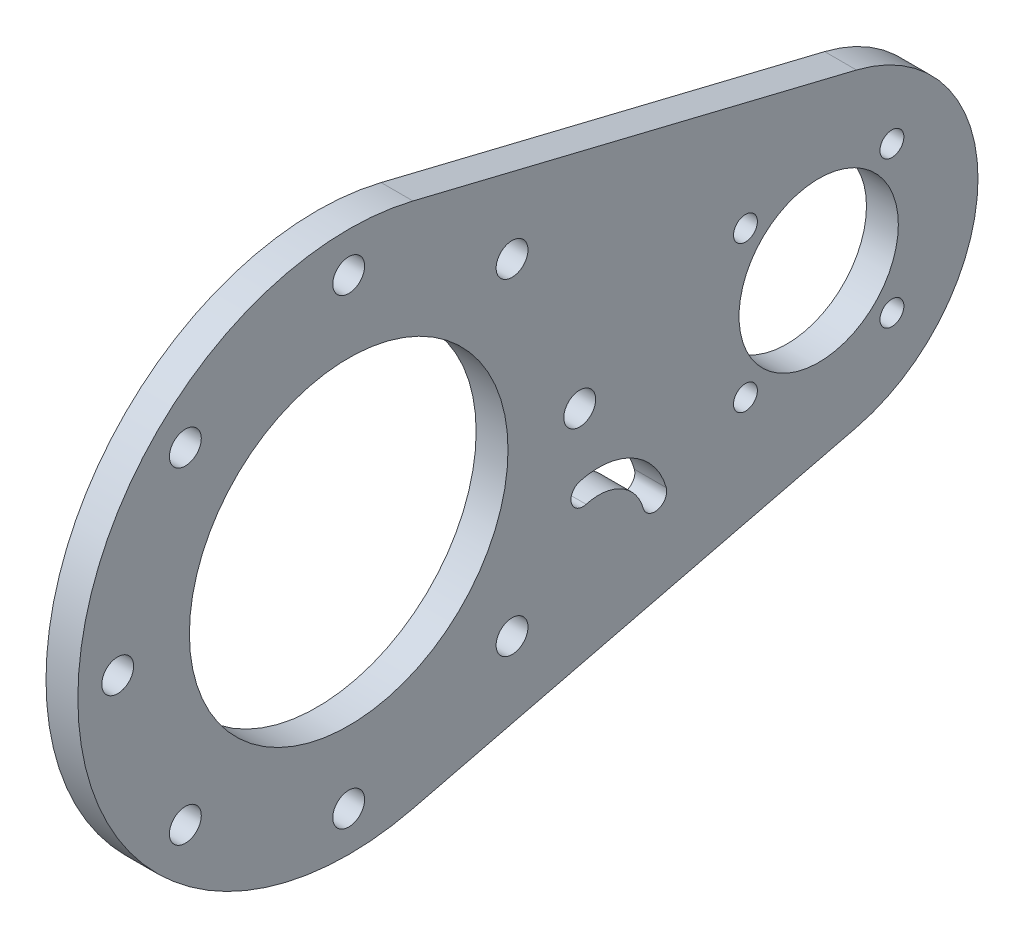
ISO-10303-21;
HEADER;
FILE_DESCRIPTION(('STEP AP214'),'2;1');
FILE_NAME('part.step','',(''),(''),'','','');
FILE_SCHEMA(('AUTOMOTIVE_DESIGN { 1 0 10303 214 1 1 1 1 }'));
ENDSEC;
DATA;
#1=APPLICATION_CONTEXT('core data for automotive mechanical design processes');
#2=APPLICATION_PROTOCOL_DEFINITION('international standard','automotive_design',2000,#1);
#3=PRODUCT_CONTEXT('',#1,'mechanical');
#4=PRODUCT('Part','Part','',(#3));
#5=PRODUCT_RELATED_PRODUCT_CATEGORY('part','',(#4));
#6=PRODUCT_DEFINITION_FORMATION('','',#4);
#7=PRODUCT_DEFINITION_CONTEXT('part definition',#1,'design');
#8=PRODUCT_DEFINITION('design','',#6,#7);
#9=PRODUCT_DEFINITION_SHAPE('','',#8);
#10=(LENGTH_UNIT() NAMED_UNIT(*) SI_UNIT(.MILLI.,.METRE.));
#11=(NAMED_UNIT(*) PLANE_ANGLE_UNIT() SI_UNIT($,.RADIAN.));
#12=(NAMED_UNIT(*) SI_UNIT($,.STERADIAN.) SOLID_ANGLE_UNIT());
#13=UNCERTAINTY_MEASURE_WITH_UNIT(LENGTH_MEASURE(1.E-05),#10,'distance_accuracy_value','');
#14=(GEOMETRIC_REPRESENTATION_CONTEXT(3) GLOBAL_UNCERTAINTY_ASSIGNED_CONTEXT((#13)) GLOBAL_UNIT_ASSIGNED_CONTEXT((#10,
#11,#12)) REPRESENTATION_CONTEXT('',''));
#15=CARTESIAN_POINT('',(0.,0.,0.));
#16=DIRECTION('',(0.,0.,1.));
#17=DIRECTION('',(1.,0.,0.));
#18=AXIS2_PLACEMENT_3D('',#15,#16,#17);
#19=CARTESIAN_POINT('',(4.,33.0289366746333,-8.06779661016949));
#20=DIRECTION('',(0.,0.971439313959804,-0.23728813559322));
#21=DIRECTION('',(0.,0.23728813559322,0.971439313959804));
#22=AXIS2_PLACEMENT_3D('',#19,#20,#21);
#23=PLANE('',#22);
#24=DIRECTION('',(0.,-0.23728813559322,-0.971439313959804));
#25=VECTOR('',#24,1.);
#26=CARTESIAN_POINT('',(0.,33.0289366746333,-8.06779661016949));
#27=LINE('',#26,#25);
#28=CARTESIAN_POINT('',(0.,33.0289366746333,-8.06779661016949));
#29=VERTEX_POINT('',#28);
#30=CARTESIAN_POINT('',(0.,19.4287862791961,-63.7457627118644));
#31=VERTEX_POINT('',#30);
#32=EDGE_CURVE('E281',#29,#31,#27,.T.);
#33=ORIENTED_EDGE('',*,*,#32,.F.);
#34=DIRECTION('',(-1.,0.,0.));
#35=VECTOR('',#34,1.);
#36=CARTESIAN_POINT('',(4.,33.0289366746333,-8.06779661016949));
#37=LINE('',#36,#35);
#38=CARTESIAN_POINT('',(4.,33.0289366746333,-8.06779661016949));
#39=VERTEX_POINT('',#38);
#40=EDGE_CURVE('E11',#39,#29,#37,.T.);
#41=ORIENTED_EDGE('',*,*,#40,.F.);
#42=DIRECTION('',(0.,-0.23728813559322,-0.971439313959804));
#43=VECTOR('',#42,1.);
#44=CARTESIAN_POINT('',(4.,33.0289366746333,-8.06779661016949));
#45=LINE('',#44,#43);
#46=CARTESIAN_POINT('',(4.,19.4287862791961,-63.7457627118644));
#47=VERTEX_POINT('',#46);
#48=EDGE_CURVE('E210',#39,#47,#45,.T.);
#49=ORIENTED_EDGE('',*,*,#48,.T.);
#50=DIRECTION('',(-1.,0.,0.));
#51=VECTOR('',#50,1.);
#52=CARTESIAN_POINT('',(4.,19.4287862791961,-63.7457627118644));
#53=LINE('',#52,#51);
#54=EDGE_CURVE('E225',#47,#31,#53,.T.);
#55=ORIENTED_EDGE('',*,*,#54,.T.);
#56=EDGE_LOOP('',(#33,#41,#49,#55));
#57=FACE_BOUND('',#56,.T.);
#58=ADVANCED_FACE('F41',(#57),#23,.T.);
#59=CARTESIAN_POINT('',(4.,0.,0.));
#60=DIRECTION('',(-1.,0.,0.));
#61=DIRECTION('',(0.,0.,1.));
#62=AXIS2_PLACEMENT_3D('',#59,#60,#61);
#63=CYLINDRICAL_SURFACE('',#62,34.);
#64=CARTESIAN_POINT('',(0.,0.,0.));
#65=DIRECTION('',(1.,0.,0.));
#66=DIRECTION('',(0.,0.,-1.));
#67=AXIS2_PLACEMENT_3D('',#64,#65,#66);
#68=CIRCLE('',#67,34.);
#69=CARTESIAN_POINT('',(0.,-33.0289366746333,-8.06779661016949));
#70=VERTEX_POINT('',#69);
#71=EDGE_CURVE('E285',#29,#70,#68,.T.);
#72=ORIENTED_EDGE('',*,*,#71,.T.);
#73=DIRECTION('',(-1.,0.,0.));
#74=VECTOR('',#73,1.);
#75=CARTESIAN_POINT('',(4.,-33.0289366746333,-8.06779661016949));
#76=LINE('',#75,#74);
#77=CARTESIAN_POINT('',(4.,-33.0289366746333,-8.06779661016949));
#78=VERTEX_POINT('',#77);
#79=EDGE_CURVE('E50',#78,#70,#76,.T.);
#80=ORIENTED_EDGE('',*,*,#79,.F.);
#81=CARTESIAN_POINT('',(4.,0.,0.));
#82=DIRECTION('',(1.,0.,0.));
#83=DIRECTION('',(0.,0.,-1.));
#84=AXIS2_PLACEMENT_3D('',#81,#82,#83);
#85=CIRCLE('',#84,34.);
#86=EDGE_CURVE('E214',#39,#78,#85,.T.);
#87=ORIENTED_EDGE('',*,*,#86,.F.);
#88=ORIENTED_EDGE('',*,*,#40,.T.);
#89=EDGE_LOOP('',(#72,#80,#87,#88));
#90=FACE_BOUND('',#89,.T.);
#91=ADVANCED_FACE('F310',(#90),#63,.T.);
#92=CARTESIAN_POINT('',(4.,-33.0289366746333,-8.06779661016949));
#93=DIRECTION('',(0.,0.971439313959804,0.23728813559322));
#94=DIRECTION('',(0.,-0.23728813559322,0.971439313959804));
#95=AXIS2_PLACEMENT_3D('',#92,#93,#94);
#96=PLANE('',#95);
#97=DIRECTION('',(0.,0.23728813559322,-0.971439313959804));
#98=VECTOR('',#97,1.);
#99=CARTESIAN_POINT('',(0.,-33.0289366746333,-8.06779661016949));
#100=LINE('',#99,#98);
#101=CARTESIAN_POINT('',(0.,-19.4287862791961,-63.7457627118644));
#102=VERTEX_POINT('',#101);
#103=EDGE_CURVE('E289',#70,#102,#100,.T.);
#104=ORIENTED_EDGE('',*,*,#103,.T.);
#105=DIRECTION('',(-1.,0.,0.));
#106=VECTOR('',#105,1.);
#107=CARTESIAN_POINT('',(4.,-19.4287862791961,-63.7457627118644));
#108=LINE('',#107,#106);
#109=CARTESIAN_POINT('',(4.,-19.4287862791961,-63.7457627118644));
#110=VERTEX_POINT('',#109);
#111=EDGE_CURVE('E298',#110,#102,#108,.T.);
#112=ORIENTED_EDGE('',*,*,#111,.F.);
#113=DIRECTION('',(0.,0.23728813559322,-0.971439313959804));
#114=VECTOR('',#113,1.);
#115=CARTESIAN_POINT('',(4.,-33.0289366746333,-8.06779661016949));
#116=LINE('',#115,#114);
#117=EDGE_CURVE('E218',#78,#110,#116,.T.);
#118=ORIENTED_EDGE('',*,*,#117,.F.);
#119=ORIENTED_EDGE('',*,*,#79,.T.);
#120=EDGE_LOOP('',(#104,#112,#118,#119));
#121=FACE_BOUND('',#120,.T.);
#122=ADVANCED_FACE('F305',(#121),#96,.F.);
#123=CARTESIAN_POINT('',(4.,0.,-59.));
#124=DIRECTION('',(-1.,0.,0.));
#125=DIRECTION('',(0.,0.,1.));
#126=AXIS2_PLACEMENT_3D('',#123,#124,#125);
#127=CYLINDRICAL_SURFACE('',#126,9.99999999999999);
#128=CARTESIAN_POINT('',(4.,0.,-59.));
#129=DIRECTION('',(1.,0.,0.));
#130=DIRECTION('',(0.,0.,-1.));
#131=AXIS2_PLACEMENT_3D('',#128,#129,#130);
#132=CIRCLE('',#131,9.99999999999999);
#133=CARTESIAN_POINT('',(4.,0.,-69.));
#134=VERTEX_POINT('',#133);
#135=EDGE_CURVE('E206',#134,#134,#132,.T.);
#136=ORIENTED_EDGE('',*,*,#135,.T.);
#137=EDGE_LOOP('',(#136));
#138=FACE_BOUND('',#137,.T.);
#139=CARTESIAN_POINT('',(0.,0.,-59.));
#140=DIRECTION('',(1.,0.,0.));
#141=DIRECTION('',(0.,0.,-1.));
#142=AXIS2_PLACEMENT_3D('',#139,#140,#141);
#143=CIRCLE('',#142,9.99999999999999);
#144=CARTESIAN_POINT('',(0.,0.,-69.));
#145=VERTEX_POINT('',#144);
#146=EDGE_CURVE('E277',#145,#145,#143,.T.);
#147=ORIENTED_EDGE('',*,*,#146,.F.);
#148=EDGE_LOOP('',(#147));
#149=FACE_BOUND('',#148,.T.);
#150=ADVANCED_FACE('F341',(#138,#149),#127,.F.);
#151=CARTESIAN_POINT('',(4.,0.,0.));
#152=DIRECTION('',(-1.,0.,0.));
#153=DIRECTION('',(0.,0.,1.));
#154=AXIS2_PLACEMENT_3D('',#151,#152,#153);
#155=CYLINDRICAL_SURFACE('',#154,20.);
#156=CARTESIAN_POINT('',(4.,0.,0.));
#157=DIRECTION('',(1.,0.,0.));
#158=DIRECTION('',(0.,0.,-1.));
#159=AXIS2_PLACEMENT_3D('',#156,#157,#158);
#160=CIRCLE('',#159,20.);
#161=CARTESIAN_POINT('',(4.,0.,-20.));
#162=VERTEX_POINT('',#161);
#163=EDGE_CURVE('E202',#162,#162,#160,.T.);
#164=ORIENTED_EDGE('',*,*,#163,.T.);
#165=EDGE_LOOP('',(#164));
#166=FACE_BOUND('',#165,.T.);
#167=CARTESIAN_POINT('',(0.,0.,0.));
#168=DIRECTION('',(1.,0.,0.));
#169=DIRECTION('',(0.,0.,-1.));
#170=AXIS2_PLACEMENT_3D('',#167,#168,#169);
#171=CIRCLE('',#170,20.);
#172=CARTESIAN_POINT('',(0.,0.,-20.));
#173=VERTEX_POINT('',#172);
#174=EDGE_CURVE('E273',#173,#173,#171,.T.);
#175=ORIENTED_EDGE('',*,*,#174,.F.);
#176=EDGE_LOOP('',(#175));
#177=FACE_BOUND('',#176,.T.);
#178=ADVANCED_FACE('F344',(#166,#177),#155,.F.);
#179=CARTESIAN_POINT('',(4.,29.,0.));
#180=DIRECTION('',(-1.,0.,0.));
#181=DIRECTION('',(0.,0.,1.));
#182=AXIS2_PLACEMENT_3D('',#179,#180,#181);
#183=CYLINDRICAL_SURFACE('',#182,2.);
#184=CARTESIAN_POINT('',(4.,29.,0.));
#185=DIRECTION('',(1.,0.,0.));
#186=DIRECTION('',(0.,0.,-1.));
#187=AXIS2_PLACEMENT_3D('',#184,#185,#186);
#188=CIRCLE('',#187,2.);
#189=CARTESIAN_POINT('',(4.,29.,-2.));
#190=VERTEX_POINT('',#189);
#191=EDGE_CURVE('E198',#190,#190,#188,.T.);
#192=ORIENTED_EDGE('',*,*,#191,.T.);
#193=EDGE_LOOP('',(#192));
#194=FACE_BOUND('',#193,.T.);
#195=CARTESIAN_POINT('',(0.,29.,0.));
#196=DIRECTION('',(1.,0.,0.));
#197=DIRECTION('',(0.,0.,-1.));
#198=AXIS2_PLACEMENT_3D('',#195,#196,#197);
#199=CIRCLE('',#198,2.);
#200=CARTESIAN_POINT('',(0.,29.,-2.));
#201=VERTEX_POINT('',#200);
#202=EDGE_CURVE('E269',#201,#201,#199,.T.);
#203=ORIENTED_EDGE('',*,*,#202,.F.);
#204=EDGE_LOOP('',(#203));
#205=FACE_BOUND('',#204,.T.);
#206=ADVANCED_FACE('F348',(#194,#205),#183,.F.);
#207=CARTESIAN_POINT('',(4.,20.5060966544099,-20.5060966544099));
#208=DIRECTION('',(-1.,0.,0.));
#209=DIRECTION('',(0.,0.,1.));
#210=AXIS2_PLACEMENT_3D('',#207,#208,#209);
#211=CYLINDRICAL_SURFACE('',#210,2.);
#212=CARTESIAN_POINT('',(4.,20.5060966544099,-20.5060966544099));
#213=DIRECTION('',(1.,0.,0.));
#214=DIRECTION('',(0.,0.,-1.));
#215=AXIS2_PLACEMENT_3D('',#212,#213,#214);
#216=CIRCLE('',#215,2.);
#217=CARTESIAN_POINT('',(4.,20.5060966544099,-22.5060966544099));
#218=VERTEX_POINT('',#217);
#219=EDGE_CURVE('E194',#218,#218,#216,.T.);
#220=ORIENTED_EDGE('',*,*,#219,.T.);
#221=EDGE_LOOP('',(#220));
#222=FACE_BOUND('',#221,.T.);
#223=CARTESIAN_POINT('',(0.,20.5060966544099,-20.5060966544099));
#224=DIRECTION('',(1.,0.,0.));
#225=DIRECTION('',(0.,0.,-1.));
#226=AXIS2_PLACEMENT_3D('',#223,#224,#225);
#227=CIRCLE('',#226,2.);
#228=CARTESIAN_POINT('',(0.,20.5060966544099,-22.5060966544099));
#229=VERTEX_POINT('',#228);
#230=EDGE_CURVE('E265',#229,#229,#227,.T.);
#231=ORIENTED_EDGE('',*,*,#230,.F.);
#232=EDGE_LOOP('',(#231));
#233=FACE_BOUND('',#232,.T.);
#234=ADVANCED_FACE('F352',(#222,#233),#211,.F.);
#235=CARTESIAN_POINT('',(4.,0.,-29.));
#236=DIRECTION('',(-1.,0.,0.));
#237=DIRECTION('',(0.,0.,1.));
#238=AXIS2_PLACEMENT_3D('',#235,#236,#237);
#239=CYLINDRICAL_SURFACE('',#238,2.);
#240=CARTESIAN_POINT('',(4.,0.,-29.));
#241=DIRECTION('',(1.,0.,0.));
#242=DIRECTION('',(0.,0.,-1.));
#243=AXIS2_PLACEMENT_3D('',#240,#241,#242);
#244=CIRCLE('',#243,2.);
#245=CARTESIAN_POINT('',(4.,0.,-31.));
#246=VERTEX_POINT('',#245);
#247=EDGE_CURVE('E190',#246,#246,#244,.T.);
#248=ORIENTED_EDGE('',*,*,#247,.T.);
#249=EDGE_LOOP('',(#248));
#250=FACE_BOUND('',#249,.T.);
#251=CARTESIAN_POINT('',(0.,0.,-29.));
#252=DIRECTION('',(1.,0.,0.));
#253=DIRECTION('',(0.,0.,-1.));
#254=AXIS2_PLACEMENT_3D('',#251,#252,#253);
#255=CIRCLE('',#254,2.);
#256=CARTESIAN_POINT('',(0.,0.,-31.));
#257=VERTEX_POINT('',#256);
#258=EDGE_CURVE('E261',#257,#257,#255,.T.);
#259=ORIENTED_EDGE('',*,*,#258,.F.);
#260=EDGE_LOOP('',(#259));
#261=FACE_BOUND('',#260,.T.);
#262=ADVANCED_FACE('F356',(#250,#261),#239,.F.);
#263=CARTESIAN_POINT('',(4.,-20.5060966544099,-20.5060966544099));
#264=DIRECTION('',(-1.,0.,0.));
#265=DIRECTION('',(0.,0.,1.));
#266=AXIS2_PLACEMENT_3D('',#263,#264,#265);
#267=CYLINDRICAL_SURFACE('',#266,2.);
#268=CARTESIAN_POINT('',(4.,-20.5060966544099,-20.5060966544099));
#269=DIRECTION('',(1.,0.,0.));
#270=DIRECTION('',(0.,0.,-1.));
#271=AXIS2_PLACEMENT_3D('',#268,#269,#270);
#272=CIRCLE('',#271,2.);
#273=CARTESIAN_POINT('',(4.,-20.5060966544099,-22.5060966544099));
#274=VERTEX_POINT('',#273);
#275=EDGE_CURVE('E186',#274,#274,#272,.T.);
#276=ORIENTED_EDGE('',*,*,#275,.T.);
#277=EDGE_LOOP('',(#276));
#278=FACE_BOUND('',#277,.T.);
#279=CARTESIAN_POINT('',(0.,-20.5060966544099,-20.5060966544099));
#280=DIRECTION('',(1.,0.,0.));
#281=DIRECTION('',(0.,0.,-1.));
#282=AXIS2_PLACEMENT_3D('',#279,#280,#281);
#283=CIRCLE('',#282,2.);
#284=CARTESIAN_POINT('',(0.,-20.5060966544099,-22.5060966544099));
#285=VERTEX_POINT('',#284);
#286=EDGE_CURVE('E257',#285,#285,#283,.T.);
#287=ORIENTED_EDGE('',*,*,#286,.F.);
#288=EDGE_LOOP('',(#287));
#289=FACE_BOUND('',#288,.T.);
#290=ADVANCED_FACE('F360',(#278,#289),#267,.F.);
#291=CARTESIAN_POINT('',(4.,-29.,0.));
#292=DIRECTION('',(-1.,0.,0.));
#293=DIRECTION('',(0.,0.,1.));
#294=AXIS2_PLACEMENT_3D('',#291,#292,#293);
#295=CYLINDRICAL_SURFACE('',#294,2.);
#296=CARTESIAN_POINT('',(4.,-29.,0.));
#297=DIRECTION('',(1.,0.,0.));
#298=DIRECTION('',(0.,0.,-1.));
#299=AXIS2_PLACEMENT_3D('',#296,#297,#298);
#300=CIRCLE('',#299,2.);
#301=CARTESIAN_POINT('',(4.,-29.,-2.00000000000001));
#302=VERTEX_POINT('',#301);
#303=EDGE_CURVE('E182',#302,#302,#300,.T.);
#304=ORIENTED_EDGE('',*,*,#303,.T.);
#305=EDGE_LOOP('',(#304));
#306=FACE_BOUND('',#305,.T.);
#307=CARTESIAN_POINT('',(0.,-29.,0.));
#308=DIRECTION('',(1.,0.,0.));
#309=DIRECTION('',(0.,0.,-1.));
#310=AXIS2_PLACEMENT_3D('',#307,#308,#309);
#311=CIRCLE('',#310,2.);
#312=CARTESIAN_POINT('',(0.,-29.,-2.00000000000001));
#313=VERTEX_POINT('',#312);
#314=EDGE_CURVE('E253',#313,#313,#311,.T.);
#315=ORIENTED_EDGE('',*,*,#314,.F.);
#316=EDGE_LOOP('',(#315));
#317=FACE_BOUND('',#316,.T.);
#318=ADVANCED_FACE('F364',(#306,#317),#295,.F.);
#319=CARTESIAN_POINT('',(4.,-20.5060966544099,20.5060966544099));
#320=DIRECTION('',(-1.,0.,0.));
#321=DIRECTION('',(0.,0.,1.));
#322=AXIS2_PLACEMENT_3D('',#319,#320,#321);
#323=CYLINDRICAL_SURFACE('',#322,2.);
#324=CARTESIAN_POINT('',(4.,-20.5060966544099,20.5060966544099));
#325=DIRECTION('',(1.,0.,0.));
#326=DIRECTION('',(0.,0.,-1.));
#327=AXIS2_PLACEMENT_3D('',#324,#325,#326);
#328=CIRCLE('',#327,2.);
#329=CARTESIAN_POINT('',(4.,-20.5060966544099,18.5060966544099));
#330=VERTEX_POINT('',#329);
#331=EDGE_CURVE('E178',#330,#330,#328,.T.);
#332=ORIENTED_EDGE('',*,*,#331,.T.);
#333=EDGE_LOOP('',(#332));
#334=FACE_BOUND('',#333,.T.);
#335=CARTESIAN_POINT('',(0.,-20.5060966544099,20.5060966544099));
#336=DIRECTION('',(1.,0.,0.));
#337=DIRECTION('',(0.,0.,-1.));
#338=AXIS2_PLACEMENT_3D('',#335,#336,#337);
#339=CIRCLE('',#338,2.);
#340=CARTESIAN_POINT('',(0.,-20.5060966544099,18.5060966544099));
#341=VERTEX_POINT('',#340);
#342=EDGE_CURVE('E249',#341,#341,#339,.T.);
#343=ORIENTED_EDGE('',*,*,#342,.F.);
#344=EDGE_LOOP('',(#343));
#345=FACE_BOUND('',#344,.T.);
#346=ADVANCED_FACE('F368',(#334,#345),#323,.F.);
#347=CARTESIAN_POINT('',(4.,0.,29.));
#348=DIRECTION('',(-1.,0.,0.));
#349=DIRECTION('',(0.,0.,1.));
#350=AXIS2_PLACEMENT_3D('',#347,#348,#349);
#351=CYLINDRICAL_SURFACE('',#350,2.);
#352=CARTESIAN_POINT('',(4.,0.,29.));
#353=DIRECTION('',(1.,0.,0.));
#354=DIRECTION('',(0.,0.,-1.));
#355=AXIS2_PLACEMENT_3D('',#352,#353,#354);
#356=CIRCLE('',#355,2.);
#357=CARTESIAN_POINT('',(4.,0.,27.));
#358=VERTEX_POINT('',#357);
#359=EDGE_CURVE('E174',#358,#358,#356,.T.);
#360=ORIENTED_EDGE('',*,*,#359,.T.);
#361=EDGE_LOOP('',(#360));
#362=FACE_BOUND('',#361,.T.);
#363=CARTESIAN_POINT('',(0.,0.,29.));
#364=DIRECTION('',(1.,0.,0.));
#365=DIRECTION('',(0.,0.,-1.));
#366=AXIS2_PLACEMENT_3D('',#363,#364,#365);
#367=CIRCLE('',#366,2.);
#368=CARTESIAN_POINT('',(0.,0.,27.));
#369=VERTEX_POINT('',#368);
#370=EDGE_CURVE('E245',#369,#369,#367,.T.);
#371=ORIENTED_EDGE('',*,*,#370,.F.);
#372=EDGE_LOOP('',(#371));
#373=FACE_BOUND('',#372,.T.);
#374=ADVANCED_FACE('F372',(#362,#373),#351,.F.);
#375=CARTESIAN_POINT('',(4.,20.5060966544099,20.5060966544099));
#376=DIRECTION('',(-1.,0.,0.));
#377=DIRECTION('',(0.,0.,1.));
#378=AXIS2_PLACEMENT_3D('',#375,#376,#377);
#379=CYLINDRICAL_SURFACE('',#378,2.);
#380=CARTESIAN_POINT('',(4.,20.5060966544099,20.5060966544099));
#381=DIRECTION('',(1.,0.,0.));
#382=DIRECTION('',(0.,0.,-1.));
#383=AXIS2_PLACEMENT_3D('',#380,#381,#382);
#384=CIRCLE('',#383,2.);
#385=CARTESIAN_POINT('',(4.,20.5060966544099,18.5060966544099));
#386=VERTEX_POINT('',#385);
#387=EDGE_CURVE('E170',#386,#386,#384,.T.);
#388=ORIENTED_EDGE('',*,*,#387,.T.);
#389=EDGE_LOOP('',(#388));
#390=FACE_BOUND('',#389,.T.);
#391=CARTESIAN_POINT('',(0.,20.5060966544099,20.5060966544099));
#392=DIRECTION('',(1.,0.,0.));
#393=DIRECTION('',(0.,0.,-1.));
#394=AXIS2_PLACEMENT_3D('',#391,#392,#393);
#395=CIRCLE('',#394,2.);
#396=CARTESIAN_POINT('',(0.,20.5060966544099,18.5060966544099));
#397=VERTEX_POINT('',#396);
#398=EDGE_CURVE('E241',#397,#397,#395,.T.);
#399=ORIENTED_EDGE('',*,*,#398,.F.);
#400=EDGE_LOOP('',(#399));
#401=FACE_BOUND('',#400,.T.);
#402=ADVANCED_FACE('F376',(#390,#401),#379,.F.);
#403=CARTESIAN_POINT('',(4.,9.19238815542507,-49.8076118445748));
#404=DIRECTION('',(-1.,0.,0.));
#405=DIRECTION('',(0.,0.,1.));
#406=AXIS2_PLACEMENT_3D('',#403,#404,#405);
#407=CYLINDRICAL_SURFACE('',#406,1.5);
#408=CARTESIAN_POINT('',(4.,9.19238815542507,-49.8076118445748));
#409=DIRECTION('',(1.,0.,0.));
#410=DIRECTION('',(0.,0.,-1.));
#411=AXIS2_PLACEMENT_3D('',#408,#409,#410);
#412=CIRCLE('',#411,1.5);
#413=CARTESIAN_POINT('',(4.,9.19238815542507,-51.3076118445748));
#414=VERTEX_POINT('',#413);
#415=EDGE_CURVE('E166',#414,#414,#412,.T.);
#416=ORIENTED_EDGE('',*,*,#415,.T.);
#417=EDGE_LOOP('',(#416));
#418=FACE_BOUND('',#417,.T.);
#419=CARTESIAN_POINT('',(0.,9.19238815542507,-49.8076118445748));
#420=DIRECTION('',(1.,0.,0.));
#421=DIRECTION('',(0.,0.,-1.));
#422=AXIS2_PLACEMENT_3D('',#419,#420,#421);
#423=CIRCLE('',#422,1.5);
#424=CARTESIAN_POINT('',(0.,9.19238815542507,-51.3076118445748));
#425=VERTEX_POINT('',#424);
#426=EDGE_CURVE('E237',#425,#425,#423,.T.);
#427=ORIENTED_EDGE('',*,*,#426,.F.);
#428=EDGE_LOOP('',(#427));
#429=FACE_BOUND('',#428,.T.);
#430=ADVANCED_FACE('F380',(#418,#429),#407,.F.);
#431=CARTESIAN_POINT('',(4.,9.19238815542517,-68.1923881554251));
#432=DIRECTION('',(-1.,0.,0.));
#433=DIRECTION('',(0.,0.,1.));
#434=AXIS2_PLACEMENT_3D('',#431,#432,#433);
#435=CYLINDRICAL_SURFACE('',#434,1.5);
#436=CARTESIAN_POINT('',(4.,9.19238815542517,-68.1923881554251));
#437=DIRECTION('',(1.,0.,0.));
#438=DIRECTION('',(0.,0.,-1.));
#439=AXIS2_PLACEMENT_3D('',#436,#437,#438);
#440=CIRCLE('',#439,1.5);
#441=CARTESIAN_POINT('',(4.,9.19238815542517,-69.6923881554251));
#442=VERTEX_POINT('',#441);
#443=EDGE_CURVE('E162',#442,#442,#440,.T.);
#444=ORIENTED_EDGE('',*,*,#443,.T.);
#445=EDGE_LOOP('',(#444));
#446=FACE_BOUND('',#445,.T.);
#447=CARTESIAN_POINT('',(0.,9.19238815542517,-68.1923881554251));
#448=DIRECTION('',(1.,0.,0.));
#449=DIRECTION('',(0.,0.,-1.));
#450=AXIS2_PLACEMENT_3D('',#447,#448,#449);
#451=CIRCLE('',#450,1.5);
#452=CARTESIAN_POINT('',(0.,9.19238815542517,-69.6923881554251));
#453=VERTEX_POINT('',#452);
#454=EDGE_CURVE('E233',#453,#453,#451,.T.);
#455=ORIENTED_EDGE('',*,*,#454,.F.);
#456=EDGE_LOOP('',(#455));
#457=FACE_BOUND('',#456,.T.);
#458=ADVANCED_FACE('F384',(#446,#457),#435,.F.);
#459=CARTESIAN_POINT('',(4.,-9.19238815542507,-68.1923881554252));
#460=DIRECTION('',(-1.,0.,0.));
#461=DIRECTION('',(0.,0.,1.));
#462=AXIS2_PLACEMENT_3D('',#459,#460,#461);
#463=CYLINDRICAL_SURFACE('',#462,1.5);
#464=CARTESIAN_POINT('',(4.,-9.19238815542507,-68.1923881554252));
#465=DIRECTION('',(1.,0.,0.));
#466=DIRECTION('',(0.,0.,-1.));
#467=AXIS2_PLACEMENT_3D('',#464,#465,#466);
#468=CIRCLE('',#467,1.5);
#469=CARTESIAN_POINT('',(4.,-9.19238815542507,-69.6923881554252));
#470=VERTEX_POINT('',#469);
#471=EDGE_CURVE('E157',#470,#470,#468,.T.);
#472=ORIENTED_EDGE('',*,*,#471,.T.);
#473=EDGE_LOOP('',(#472));
#474=FACE_BOUND('',#473,.T.);
#475=CARTESIAN_POINT('',(0.,-9.19238815542507,-68.1923881554252));
#476=DIRECTION('',(1.,0.,0.));
#477=DIRECTION('',(0.,0.,-1.));
#478=AXIS2_PLACEMENT_3D('',#475,#476,#477);
#479=CIRCLE('',#478,1.5);
#480=CARTESIAN_POINT('',(0.,-9.19238815542507,-69.6923881554252));
#481=VERTEX_POINT('',#480);
#482=EDGE_CURVE('E229',#481,#481,#479,.T.);
#483=ORIENTED_EDGE('',*,*,#482,.F.);
#484=EDGE_LOOP('',(#483));
#485=FACE_BOUND('',#484,.T.);
#486=ADVANCED_FACE('F387',(#474,#485),#463,.F.);
#487=CARTESIAN_POINT('',(4.,-9.19238815542517,-49.8076118445749));
#488=DIRECTION('',(-1.,0.,0.));
#489=DIRECTION('',(0.,0.,1.));
#490=AXIS2_PLACEMENT_3D('',#487,#488,#489);
#491=CYLINDRICAL_SURFACE('',#490,1.50000000000003);
#492=CARTESIAN_POINT('',(4.,-9.19238815542517,-49.8076118445749));
#493=DIRECTION('',(1.,0.,0.));
#494=DIRECTION('',(0.,0.,-1.));
#495=AXIS2_PLACEMENT_3D('',#492,#493,#494);
#496=CIRCLE('',#495,1.50000000000003);
#497=CARTESIAN_POINT('',(4.,-9.19238815542517,-51.307611844575));
#498=VERTEX_POINT('',#497);
#499=EDGE_CURVE('E153',#498,#498,#496,.T.);
#500=ORIENTED_EDGE('',*,*,#499,.T.);
#501=EDGE_LOOP('',(#500));
#502=FACE_BOUND('',#501,.T.);
#503=CARTESIAN_POINT('',(0.,-9.19238815542517,-49.8076118445749));
#504=DIRECTION('',(1.,0.,0.));
#505=DIRECTION('',(0.,0.,-1.));
#506=AXIS2_PLACEMENT_3D('',#503,#504,#505);
#507=CIRCLE('',#506,1.50000000000003);
#508=CARTESIAN_POINT('',(0.,-9.19238815542517,-51.307611844575));
#509=VERTEX_POINT('',#508);
#510=EDGE_CURVE('E152',#509,#509,#507,.T.);
#511=ORIENTED_EDGE('',*,*,#510,.F.);
#512=EDGE_LOOP('',(#511));
#513=FACE_BOUND('',#512,.T.);
#514=ADVANCED_FACE('F43',(#502,#513),#491,.F.);
#515=CARTESIAN_POINT('',(4.,0.,-59.));
#516=DIRECTION('',(-1.,0.,0.));
#517=DIRECTION('',(0.,0.,1.));
#518=AXIS2_PLACEMENT_3D('',#515,#516,#517);
#519=CYLINDRICAL_SURFACE('',#518,20.);
#520=CARTESIAN_POINT('',(0.,0.,-59.));
#521=DIRECTION('',(1.,0.,0.));
#522=DIRECTION('',(0.,0.,-1.));
#523=AXIS2_PLACEMENT_3D('',#520,#521,#522);
#524=CIRCLE('',#523,20.);
#525=EDGE_CURVE('E158',#102,#31,#524,.T.);
#526=ORIENTED_EDGE('',*,*,#525,.T.);
#527=ORIENTED_EDGE('',*,*,#54,.F.);
#528=CARTESIAN_POINT('',(4.,0.,-59.));
#529=DIRECTION('',(1.,0.,0.));
#530=DIRECTION('',(0.,0.,-1.));
#531=AXIS2_PLACEMENT_3D('',#528,#529,#530);
#532=CIRCLE('',#531,20.);
#533=EDGE_CURVE('E222',#110,#47,#532,.T.);
#534=ORIENTED_EDGE('',*,*,#533,.F.);
#535=ORIENTED_EDGE('',*,*,#111,.T.);
#536=EDGE_LOOP('',(#526,#527,#534,#535));
#537=FACE_BOUND('',#536,.T.);
#538=ADVANCED_FACE('F317',(#537),#519,.T.);
#539=CARTESIAN_POINT('',(4.,0.,0.));
#540=DIRECTION('',(1.,0.,0.));
#541=DIRECTION('',(0.,0.,-1.));
#542=AXIS2_PLACEMENT_3D('',#539,#540,#541);
#543=PLANE('',#542);
#544=CARTESIAN_POINT('',(4.,-9.37359280232875,-29.4005316634005));
#545=DIRECTION('',(1.,0.,0.));
#546=DIRECTION('',(0.,0.,-1.));
#547=AXIS2_PLACEMENT_3D('',#544,#545,#546);
#548=CIRCLE('',#547,1.5);
#549=CARTESIAN_POINT('',(4.,-7.92941021758091,-28.9951470782088));
#550=VERTEX_POINT('',#549);
#551=CARTESIAN_POINT('',(4.,-10.8177753870766,-29.8059162485922));
#552=VERTEX_POINT('',#551);
#553=EDGE_CURVE('E149',#550,#552,#548,.T.);
#554=ORIENTED_EDGE('',*,*,#553,.F.);
#555=CARTESIAN_POINT('',(4.,-16.4168965654573,-31.3775993863806));
#556=DIRECTION('',(1.,0.,0.));
#557=DIRECTION('',(0.,0.,-1.));
#558=AXIS2_PLACEMENT_3D('',#555,#556,#557);
#559=CIRCLE('',#558,8.81552627505025);
#560=CARTESIAN_POINT('',(4.,-14.034444257278,-39.8650857342549));
#561=VERTEX_POINT('',#560);
#562=EDGE_CURVE('E137',#561,#550,#559,.T.);
#563=ORIENTED_EDGE('',*,*,#562,.F.);
#564=CARTESIAN_POINT('',(4.,-14.439828842471,-38.4209031495074));
#565=DIRECTION('',(1.,0.,0.));
#566=DIRECTION('',(0.,0.,-1.));
#567=AXIS2_PLACEMENT_3D('',#564,#565,#566);
#568=CIRCLE('',#567,1.5);
#569=CARTESIAN_POINT('',(4.,-14.8452134276639,-36.9767205647599));
#570=VERTEX_POINT('',#569);
#571=EDGE_CURVE('E112',#570,#561,#568,.T.);
#572=ORIENTED_EDGE('',*,*,#571,.F.);
#573=CARTESIAN_POINT('',(4.,-16.4168965654573,-31.3775993863806));
#574=DIRECTION('',(1.,0.,0.));
#575=DIRECTION('',(0.,0.,-1.));
#576=AXIS2_PLACEMENT_3D('',#573,#574,#575);
#577=CIRCLE('',#576,5.81552627505025);
#578=EDGE_CURVE('E146',#552,#570,#577,.F.);
#579=ORIENTED_EDGE('',*,*,#578,.F.);
#580=EDGE_LOOP('',(#554,#563,#572,#579));
#581=FACE_BOUND('',#580,.T.);
#582=ORIENTED_EDGE('',*,*,#499,.F.);
#583=EDGE_LOOP('',(#582));
#584=FACE_BOUND('',#583,.T.);
#585=ORIENTED_EDGE('',*,*,#471,.F.);
#586=EDGE_LOOP('',(#585));
#587=FACE_BOUND('',#586,.T.);
#588=ORIENTED_EDGE('',*,*,#443,.F.);
#589=EDGE_LOOP('',(#588));
#590=FACE_BOUND('',#589,.T.);
#591=ORIENTED_EDGE('',*,*,#415,.F.);
#592=EDGE_LOOP('',(#591));
#593=FACE_BOUND('',#592,.T.);
#594=ORIENTED_EDGE('',*,*,#387,.F.);
#595=EDGE_LOOP('',(#594));
#596=FACE_BOUND('',#595,.T.);
#597=ORIENTED_EDGE('',*,*,#359,.F.);
#598=EDGE_LOOP('',(#597));
#599=FACE_BOUND('',#598,.T.);
#600=ORIENTED_EDGE('',*,*,#331,.F.);
#601=EDGE_LOOP('',(#600));
#602=FACE_BOUND('',#601,.T.);
#603=ORIENTED_EDGE('',*,*,#303,.F.);
#604=EDGE_LOOP('',(#603));
#605=FACE_BOUND('',#604,.T.);
#606=ORIENTED_EDGE('',*,*,#275,.F.);
#607=EDGE_LOOP('',(#606));
#608=FACE_BOUND('',#607,.T.);
#609=ORIENTED_EDGE('',*,*,#247,.F.);
#610=EDGE_LOOP('',(#609));
#611=FACE_BOUND('',#610,.T.);
#612=ORIENTED_EDGE('',*,*,#219,.F.);
#613=EDGE_LOOP('',(#612));
#614=FACE_BOUND('',#613,.T.);
#615=ORIENTED_EDGE('',*,*,#191,.F.);
#616=EDGE_LOOP('',(#615));
#617=FACE_BOUND('',#616,.T.);
#618=ORIENTED_EDGE('',*,*,#163,.F.);
#619=EDGE_LOOP('',(#618));
#620=FACE_BOUND('',#619,.T.);
#621=ORIENTED_EDGE('',*,*,#135,.F.);
#622=EDGE_LOOP('',(#621));
#623=FACE_BOUND('',#622,.T.);
#624=ORIENTED_EDGE('',*,*,#48,.F.);
#625=ORIENTED_EDGE('',*,*,#86,.T.);
#626=ORIENTED_EDGE('',*,*,#117,.T.);
#627=ORIENTED_EDGE('',*,*,#533,.T.);
#628=EDGE_LOOP('',(#624,#625,#626,#627));
#629=FACE_BOUND('',#628,.T.);
#630=ADVANCED_FACE('F319',(#581,#584,#587,#590,#593,#596,#599,#602,#605,#608,#611,#614,#617,
#620,#623,#629),#543,.T.);
#631=CARTESIAN_POINT('',(0.,0.,0.));
#632=DIRECTION('',(1.,0.,0.));
#633=DIRECTION('',(0.,0.,-1.));
#634=AXIS2_PLACEMENT_3D('',#631,#632,#633);
#635=PLANE('',#634);
#636=CARTESIAN_POINT('',(0.,-16.4168965654573,-31.3775993863806));
#637=DIRECTION('',(-1.,0.,0.));
#638=DIRECTION('',(0.,0.,1.));
#639=AXIS2_PLACEMENT_3D('',#636,#637,#638);
#640=CIRCLE('',#639,8.81552627505025);
#641=CARTESIAN_POINT('',(0.,-7.92941021758091,-28.9951470782088));
#642=VERTEX_POINT('',#641);
#643=CARTESIAN_POINT('',(0.,-14.034444257278,-39.8650857342549));
#644=VERTEX_POINT('',#643);
#645=EDGE_CURVE('E119',#642,#644,#640,.T.);
#646=ORIENTED_EDGE('',*,*,#645,.F.);
#647=CARTESIAN_POINT('',(0.,-9.37359280232875,-29.4005316634005));
#648=DIRECTION('',(-1.,0.,0.));
#649=DIRECTION('',(0.,0.,1.));
#650=AXIS2_PLACEMENT_3D('',#647,#648,#649);
#651=CIRCLE('',#650,1.5);
#652=CARTESIAN_POINT('',(0.,-10.8177753870766,-29.8059162485922));
#653=VERTEX_POINT('',#652);
#654=EDGE_CURVE('E65',#653,#642,#651,.T.);
#655=ORIENTED_EDGE('',*,*,#654,.F.);
#656=CARTESIAN_POINT('',(0.,-16.4168965654573,-31.3775993863806));
#657=DIRECTION('',(1.,0.,0.));
#658=DIRECTION('',(0.,0.,1.));
#659=AXIS2_PLACEMENT_3D('',#656,#657,#658);
#660=CIRCLE('',#659,5.81552627505025);
#661=CARTESIAN_POINT('',(0.,-14.8452134276639,-36.9767205647599));
#662=VERTEX_POINT('',#661);
#663=EDGE_CURVE('E127',#662,#653,#660,.T.);
#664=ORIENTED_EDGE('',*,*,#663,.F.);
#665=CARTESIAN_POINT('',(0.,-14.439828842471,-38.4209031495074));
#666=DIRECTION('',(-1.,0.,0.));
#667=DIRECTION('',(0.,0.,1.));
#668=AXIS2_PLACEMENT_3D('',#665,#666,#667);
#669=CIRCLE('',#668,1.5);
#670=EDGE_CURVE('E109',#644,#662,#669,.T.);
#671=ORIENTED_EDGE('',*,*,#670,.F.);
#672=EDGE_LOOP('',(#646,#655,#664,#671));
#673=FACE_BOUND('',#672,.T.);
#674=ORIENTED_EDGE('',*,*,#510,.T.);
#675=EDGE_LOOP('',(#674));
#676=FACE_BOUND('',#675,.T.);
#677=ORIENTED_EDGE('',*,*,#482,.T.);
#678=EDGE_LOOP('',(#677));
#679=FACE_BOUND('',#678,.T.);
#680=ORIENTED_EDGE('',*,*,#454,.T.);
#681=EDGE_LOOP('',(#680));
#682=FACE_BOUND('',#681,.T.);
#683=ORIENTED_EDGE('',*,*,#426,.T.);
#684=EDGE_LOOP('',(#683));
#685=FACE_BOUND('',#684,.T.);
#686=ORIENTED_EDGE('',*,*,#398,.T.);
#687=EDGE_LOOP('',(#686));
#688=FACE_BOUND('',#687,.T.);
#689=ORIENTED_EDGE('',*,*,#370,.T.);
#690=EDGE_LOOP('',(#689));
#691=FACE_BOUND('',#690,.T.);
#692=ORIENTED_EDGE('',*,*,#342,.T.);
#693=EDGE_LOOP('',(#692));
#694=FACE_BOUND('',#693,.T.);
#695=ORIENTED_EDGE('',*,*,#314,.T.);
#696=EDGE_LOOP('',(#695));
#697=FACE_BOUND('',#696,.T.);
#698=ORIENTED_EDGE('',*,*,#286,.T.);
#699=EDGE_LOOP('',(#698));
#700=FACE_BOUND('',#699,.T.);
#701=ORIENTED_EDGE('',*,*,#258,.T.);
#702=EDGE_LOOP('',(#701));
#703=FACE_BOUND('',#702,.T.);
#704=ORIENTED_EDGE('',*,*,#230,.T.);
#705=EDGE_LOOP('',(#704));
#706=FACE_BOUND('',#705,.T.);
#707=ORIENTED_EDGE('',*,*,#202,.T.);
#708=EDGE_LOOP('',(#707));
#709=FACE_BOUND('',#708,.T.);
#710=ORIENTED_EDGE('',*,*,#174,.T.);
#711=EDGE_LOOP('',(#710));
#712=FACE_BOUND('',#711,.T.);
#713=ORIENTED_EDGE('',*,*,#146,.T.);
#714=EDGE_LOOP('',(#713));
#715=FACE_BOUND('',#714,.T.);
#716=ORIENTED_EDGE('',*,*,#32,.T.);
#717=ORIENTED_EDGE('',*,*,#525,.F.);
#718=ORIENTED_EDGE('',*,*,#103,.F.);
#719=ORIENTED_EDGE('',*,*,#71,.F.);
#720=EDGE_LOOP('',(#716,#717,#718,#719));
#721=FACE_BOUND('',#720,.T.);
#722=ADVANCED_FACE('F124',(#673,#676,#679,#682,#685,#688,#691,#694,#697,#700,#703,#706,#709,
#712,#715,#721),#635,.F.);
#723=CARTESIAN_POINT('',(10.,-9.37359280232875,-29.4005316634005));
#724=DIRECTION('',(-1.,0.,0.));
#725=DIRECTION('',(0.,0.,1.));
#726=AXIS2_PLACEMENT_3D('',#723,#724,#725);
#727=CYLINDRICAL_SURFACE('',#726,1.5);
#728=ORIENTED_EDGE('',*,*,#553,.T.);
#729=DIRECTION('',(-1.,0.,0.));
#730=VECTOR('',#729,1.);
#731=CARTESIAN_POINT('',(10.,-10.8177753870766,-29.8059162485922));
#732=LINE('',#731,#730);
#733=EDGE_CURVE('E134',#552,#653,#732,.T.);
#734=ORIENTED_EDGE('',*,*,#733,.T.);
#735=ORIENTED_EDGE('',*,*,#654,.T.);
#736=DIRECTION('',(-1.,0.,0.));
#737=VECTOR('',#736,1.);
#738=CARTESIAN_POINT('',(10.,-7.92941021758091,-28.9951470782088));
#739=LINE('',#738,#737);
#740=EDGE_CURVE('E116',#550,#642,#739,.T.);
#741=ORIENTED_EDGE('',*,*,#740,.F.);
#742=EDGE_LOOP('',(#728,#734,#735,#741));
#743=FACE_BOUND('',#742,.T.);
#744=ADVANCED_FACE('F327',(#743),#727,.F.);
#745=CARTESIAN_POINT('',(10.,-16.4168965654573,-31.3775993863806));
#746=DIRECTION('',(-1.,0.,0.));
#747=DIRECTION('',(0.,0.,1.));
#748=AXIS2_PLACEMENT_3D('',#745,#746,#747);
#749=CYLINDRICAL_SURFACE('',#748,5.81552627505025);
#750=ORIENTED_EDGE('',*,*,#578,.T.);
#751=DIRECTION('',(-1.,0.,0.));
#752=VECTOR('',#751,1.);
#753=CARTESIAN_POINT('',(10.,-14.8452134276639,-36.9767205647599));
#754=LINE('',#753,#752);
#755=EDGE_CURVE('E115',#570,#662,#754,.T.);
#756=ORIENTED_EDGE('',*,*,#755,.T.);
#757=ORIENTED_EDGE('',*,*,#663,.T.);
#758=ORIENTED_EDGE('',*,*,#733,.F.);
#759=EDGE_LOOP('',(#750,#756,#757,#758));
#760=FACE_BOUND('',#759,.T.);
#761=ADVANCED_FACE('F490',(#760),#749,.T.);
#762=CARTESIAN_POINT('',(10.,-14.439828842471,-38.4209031495074));
#763=DIRECTION('',(-1.,0.,0.));
#764=DIRECTION('',(0.,0.,1.));
#765=AXIS2_PLACEMENT_3D('',#762,#763,#764);
#766=CYLINDRICAL_SURFACE('',#765,1.5);
#767=ORIENTED_EDGE('',*,*,#571,.T.);
#768=DIRECTION('',(-1.,0.,0.));
#769=VECTOR('',#768,1.);
#770=CARTESIAN_POINT('',(10.,-14.034444257278,-39.8650857342549));
#771=LINE('',#770,#769);
#772=EDGE_CURVE('E57',#561,#644,#771,.T.);
#773=ORIENTED_EDGE('',*,*,#772,.T.);
#774=ORIENTED_EDGE('',*,*,#670,.T.);
#775=ORIENTED_EDGE('',*,*,#755,.F.);
#776=EDGE_LOOP('',(#767,#773,#774,#775));
#777=FACE_BOUND('',#776,.T.);
#778=ADVANCED_FACE('F106',(#777),#766,.F.);
#779=CARTESIAN_POINT('',(10.,-16.4168965654573,-31.3775993863806));
#780=DIRECTION('',(-1.,0.,0.));
#781=DIRECTION('',(0.,0.,1.));
#782=AXIS2_PLACEMENT_3D('',#779,#780,#781);
#783=CYLINDRICAL_SURFACE('',#782,8.81552627505025);
#784=ORIENTED_EDGE('',*,*,#562,.T.);
#785=ORIENTED_EDGE('',*,*,#740,.T.);
#786=ORIENTED_EDGE('',*,*,#645,.T.);
#787=ORIENTED_EDGE('',*,*,#772,.F.);
#788=EDGE_LOOP('',(#784,#785,#786,#787));
#789=FACE_BOUND('',#788,.T.);
#790=ADVANCED_FACE('F120',(#789),#783,.F.);
#791=CLOSED_SHELL('',(#58,#91,#122,#150,#178,#206,#234,#262,#290,#318,#346,#374,#402,#430,#458,
#486,#514,#538,#630,#722,#744,#761,#778,#790));
#792=MANIFOLD_SOLID_BREP('B2',#791);
#793=ADVANCED_BREP_SHAPE_REPRESENTATION('',(#18,#792),#14);
#794=SHAPE_DEFINITION_REPRESENTATION(#9,#793);
ENDSEC;
END-ISO-10303-21;
